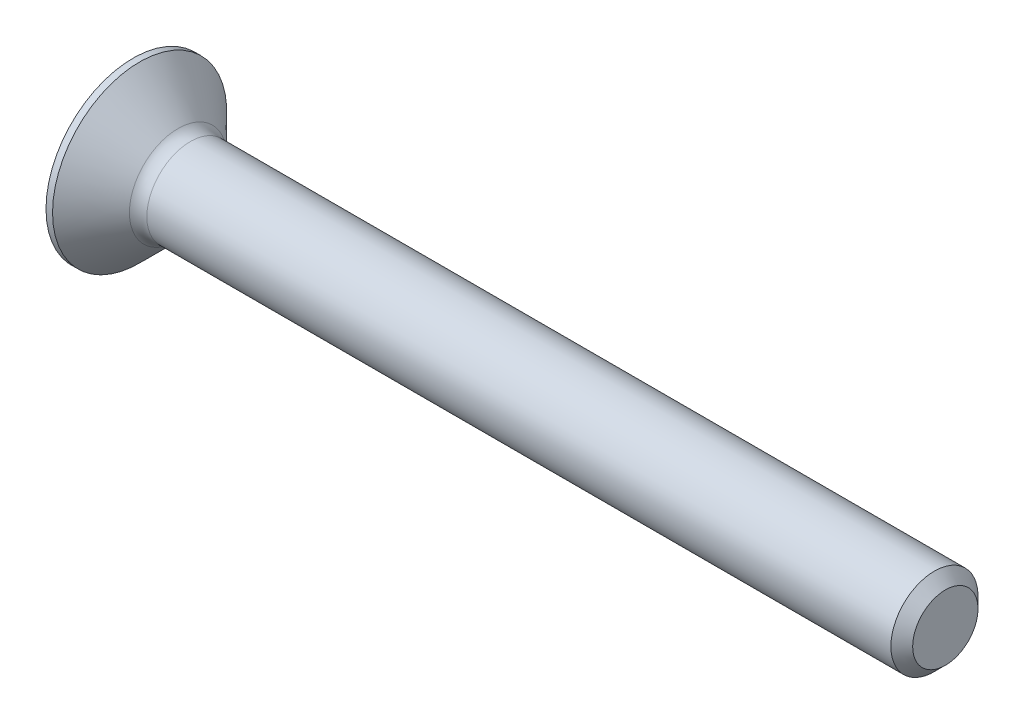
ISO-10303-21;
HEADER;
FILE_DESCRIPTION(('STEP AP214'),'2;1');
FILE_NAME('part.step','',(''),(''),'','','');
FILE_SCHEMA(('AUTOMOTIVE_DESIGN { 1 0 10303 214 1 1 1 1 }'));
ENDSEC;
DATA;
#1=APPLICATION_CONTEXT('core data for automotive mechanical design processes');
#2=APPLICATION_PROTOCOL_DEFINITION('international standard','automotive_design',2000,#1);
#3=PRODUCT_CONTEXT('',#1,'mechanical');
#4=PRODUCT('Part','Part','',(#3));
#5=PRODUCT_RELATED_PRODUCT_CATEGORY('part','',(#4));
#6=PRODUCT_DEFINITION_FORMATION('','',#4);
#7=PRODUCT_DEFINITION_CONTEXT('part definition',#1,'design');
#8=PRODUCT_DEFINITION('design','',#6,#7);
#9=PRODUCT_DEFINITION_SHAPE('','',#8);
#10=(LENGTH_UNIT() NAMED_UNIT(*) SI_UNIT(.MILLI.,.METRE.));
#11=(NAMED_UNIT(*) PLANE_ANGLE_UNIT() SI_UNIT($,.RADIAN.));
#12=(NAMED_UNIT(*) SI_UNIT($,.STERADIAN.) SOLID_ANGLE_UNIT());
#13=UNCERTAINTY_MEASURE_WITH_UNIT(LENGTH_MEASURE(1.E-05),#10,'distance_accuracy_value','');
#14=(GEOMETRIC_REPRESENTATION_CONTEXT(3) GLOBAL_UNCERTAINTY_ASSIGNED_CONTEXT((#13)) GLOBAL_UNIT_ASSIGNED_CONTEXT((#10,
#11,#12)) REPRESENTATION_CONTEXT('',''));
#15=CARTESIAN_POINT('',(0.,0.,0.));
#16=DIRECTION('',(0.,0.,1.));
#17=DIRECTION('',(1.,0.,0.));
#18=AXIS2_PLACEMENT_3D('',#15,#16,#17);
#19=CARTESIAN_POINT('',(0.,0.,0.));
#20=DIRECTION('',(-1.,0.,0.));
#21=DIRECTION('',(0.,0.,1.));
#22=AXIS2_PLACEMENT_3D('',#19,#20,#21);
#23=PLANE('',#22);
#24=CARTESIAN_POINT('',(0.,0.,0.));
#25=DIRECTION('',(-1.,0.,0.));
#26=DIRECTION('',(0.,0.,1.));
#27=AXIS2_PLACEMENT_3D('',#24,#25,#26);
#28=CIRCLE('',#27,4.);
#29=CARTESIAN_POINT('',(0.,0.,4.));
#30=VERTEX_POINT('',#29);
#31=EDGE_CURVE('E131',#30,#30,#28,.T.);
#32=ORIENTED_EDGE('',*,*,#31,.T.);
#33=EDGE_LOOP('',(#32));
#34=FACE_BOUND('',#33,.T.);
#35=DIRECTION('',(0.,-0.5,-0.866025403784439));
#36=VECTOR('',#35,1.);
#37=CARTESIAN_POINT('',(0.,-0.721687836487032,1.25));
#38=LINE('',#37,#36);
#39=CARTESIAN_POINT('',(0.,-0.721687836487032,1.25));
#40=VERTEX_POINT('',#39);
#41=CARTESIAN_POINT('',(0.,-1.44337567297406,0.));
#42=VERTEX_POINT('',#41);
#43=EDGE_CURVE('E32',#40,#42,#38,.T.);
#44=ORIENTED_EDGE('',*,*,#43,.T.);
#45=DIRECTION('',(0.,0.5,-0.866025403784439));
#46=VECTOR('',#45,1.);
#47=CARTESIAN_POINT('',(0.,-1.44337567297406,0.));
#48=LINE('',#47,#46);
#49=CARTESIAN_POINT('',(0.,-0.721687836487032,-1.25));
#50=VERTEX_POINT('',#49);
#51=EDGE_CURVE('E102',#42,#50,#48,.T.);
#52=ORIENTED_EDGE('',*,*,#51,.T.);
#53=DIRECTION('',(0.,1.,0.));
#54=VECTOR('',#53,1.);
#55=CARTESIAN_POINT('',(0.,-0.721687836487032,-1.25));
#56=LINE('',#55,#54);
#57=CARTESIAN_POINT('',(0.,0.721687836487033,-1.25));
#58=VERTEX_POINT('',#57);
#59=EDGE_CURVE('E104',#50,#58,#56,.T.);
#60=ORIENTED_EDGE('',*,*,#59,.T.);
#61=DIRECTION('',(0.,0.5,0.866025403784438));
#62=VECTOR('',#61,1.);
#63=CARTESIAN_POINT('',(0.,0.721687836487033,-1.25));
#64=LINE('',#63,#62);
#65=CARTESIAN_POINT('',(0.,1.44337567297407,0.));
#66=VERTEX_POINT('',#65);
#67=EDGE_CURVE('E106',#58,#66,#64,.T.);
#68=ORIENTED_EDGE('',*,*,#67,.T.);
#69=DIRECTION('',(0.,-0.5,0.866025403784439));
#70=VECTOR('',#69,1.);
#71=CARTESIAN_POINT('',(0.,1.44337567297407,0.));
#72=LINE('',#71,#70);
#73=CARTESIAN_POINT('',(0.,0.721687836487033,1.25));
#74=VERTEX_POINT('',#73);
#75=EDGE_CURVE('E108',#66,#74,#72,.T.);
#76=ORIENTED_EDGE('',*,*,#75,.T.);
#77=DIRECTION('',(0.,-1.,0.));
#78=VECTOR('',#77,1.);
#79=CARTESIAN_POINT('',(0.,0.721687836487033,1.25));
#80=LINE('',#79,#78);
#81=EDGE_CURVE('E61',#74,#40,#80,.T.);
#82=ORIENTED_EDGE('',*,*,#81,.T.);
#83=EDGE_LOOP('',(#44,#52,#60,#68,#76,#82));
#84=FACE_BOUND('',#83,.T.);
#85=ADVANCED_FACE('F17',(#34,#84),#23,.T.);
#86=CARTESIAN_POINT('',(0.,0.,0.));
#87=DIRECTION('',(-1.,0.,0.));
#88=DIRECTION('',(0.,0.,1.));
#89=AXIS2_PLACEMENT_3D('',#86,#87,#88);
#90=CYLINDRICAL_SURFACE('',#89,4.);
#91=CARTESIAN_POINT('',(0.30000000000001,0.,0.));
#92=DIRECTION('',(-1.,0.,0.));
#93=DIRECTION('',(0.,0.,1.));
#94=AXIS2_PLACEMENT_3D('',#91,#92,#93);
#95=CIRCLE('',#94,4.);
#96=CARTESIAN_POINT('',(0.30000000000001,0.,4.));
#97=VERTEX_POINT('',#96);
#98=EDGE_CURVE('E128',#97,#97,#95,.T.);
#99=ORIENTED_EDGE('',*,*,#98,.T.);
#100=EDGE_LOOP('',(#99));
#101=FACE_BOUND('',#100,.T.);
#102=ORIENTED_EDGE('',*,*,#31,.F.);
#103=EDGE_LOOP('',(#102));
#104=FACE_BOUND('',#103,.T.);
#105=ADVANCED_FACE('F156',(#101,#104),#90,.T.);
#106=CARTESIAN_POINT('',(0.30000000000001,0.,0.));
#107=DIRECTION('',(-1.,0.,0.));
#108=DIRECTION('',(0.,0.,1.));
#109=AXIS2_PLACEMENT_3D('',#106,#107,#108);
#110=CONICAL_SURFACE('',#109,4.,0.78539816339745);
#111=CARTESIAN_POINT('',(2.06568542494924,0.,0.));
#112=DIRECTION('',(-1.,0.,0.));
#113=DIRECTION('',(0.,0.,1.));
#114=AXIS2_PLACEMENT_3D('',#111,#112,#113);
#115=CIRCLE('',#114,2.23431457505077);
#116=CARTESIAN_POINT('',(2.06568542494924,0.,2.23431457505077));
#117=VERTEX_POINT('',#116);
#118=EDGE_CURVE('E25',#117,#117,#115,.T.);
#119=ORIENTED_EDGE('',*,*,#118,.T.);
#120=EDGE_LOOP('',(#119));
#121=FACE_BOUND('',#120,.T.);
#122=ORIENTED_EDGE('',*,*,#98,.F.);
#123=EDGE_LOOP('',(#122));
#124=FACE_BOUND('',#123,.T.);
#125=ADVANCED_FACE('F136',(#121,#124),#110,.T.);
#126=CARTESIAN_POINT('',(0.,0.,0.));
#127=DIRECTION('',(-1.,0.,0.));
#128=DIRECTION('',(0.,0.,1.));
#129=AXIS2_PLACEMENT_3D('',#126,#127,#128);
#130=CYLINDRICAL_SURFACE('',#129,2.);
#131=CARTESIAN_POINT('',(2.63137084989848,0.,0.));
#132=DIRECTION('',(-1.,0.,0.));
#133=DIRECTION('',(0.,0.,1.));
#134=AXIS2_PLACEMENT_3D('',#131,#132,#133);
#135=CIRCLE('',#134,2.);
#136=CARTESIAN_POINT('',(2.63137084989848,0.,2.));
#137=VERTEX_POINT('',#136);
#138=EDGE_CURVE('E11',#137,#137,#135,.F.);
#139=ORIENTED_EDGE('',*,*,#138,.T.);
#140=EDGE_LOOP('',(#139));
#141=FACE_BOUND('',#140,.T.);
#142=CARTESIAN_POINT('',(36.8,0.,0.));
#143=DIRECTION('',(-1.,0.,0.));
#144=DIRECTION('',(0.,0.,1.));
#145=AXIS2_PLACEMENT_3D('',#142,#143,#144);
#146=CIRCLE('',#145,2.);
#147=CARTESIAN_POINT('',(36.8,0.,2.));
#148=VERTEX_POINT('',#147);
#149=EDGE_CURVE('E125',#148,#148,#146,.T.);
#150=ORIENTED_EDGE('',*,*,#149,.T.);
#151=EDGE_LOOP('',(#150));
#152=FACE_BOUND('',#151,.T.);
#153=ADVANCED_FACE('F166',(#141,#152),#130,.T.);
#154=CARTESIAN_POINT('',(37.3,0.,0.));
#155=DIRECTION('',(-1.,0.,0.));
#156=DIRECTION('',(0.,0.,1.));
#157=AXIS2_PLACEMENT_3D('',#154,#155,#156);
#158=CONICAL_SURFACE('',#157,1.5,0.785398163397462);
#159=ORIENTED_EDGE('',*,*,#149,.F.);
#160=EDGE_LOOP('',(#159));
#161=FACE_BOUND('',#160,.T.);
#162=CARTESIAN_POINT('',(37.3,0.,0.));
#163=DIRECTION('',(-1.,0.,0.));
#164=DIRECTION('',(0.,0.,1.));
#165=AXIS2_PLACEMENT_3D('',#162,#163,#164);
#166=CIRCLE('',#165,1.5);
#167=CARTESIAN_POINT('',(37.3,0.,1.5));
#168=VERTEX_POINT('',#167);
#169=EDGE_CURVE('E122',#168,#168,#166,.T.);
#170=ORIENTED_EDGE('',*,*,#169,.T.);
#171=EDGE_LOOP('',(#170));
#172=FACE_BOUND('',#171,.T.);
#173=ADVANCED_FACE('F151',(#161,#172),#158,.T.);
#174=CARTESIAN_POINT('',(37.3,1.5,0.));
#175=DIRECTION('',(1.,0.,0.));
#176=DIRECTION('',(0.,0.,-1.));
#177=AXIS2_PLACEMENT_3D('',#174,#175,#176);
#178=PLANE('',#177);
#179=ORIENTED_EDGE('',*,*,#169,.F.);
#180=EDGE_LOOP('',(#179));
#181=FACE_BOUND('',#180,.T.);
#182=ADVANCED_FACE('F141',(#181),#178,.T.);
#183=CARTESIAN_POINT('',(2.63137084989848,0.,0.));
#184=DIRECTION('',(-1.,0.,0.));
#185=DIRECTION('',(0.,0.,1.));
#186=AXIS2_PLACEMENT_3D('',#183,#184,#185);
#187=TOROIDAL_SURFACE('',#186,2.8,0.8);
#188=ORIENTED_EDGE('',*,*,#138,.F.);
#189=EDGE_LOOP('',(#188));
#190=FACE_BOUND('',#189,.T.);
#191=ORIENTED_EDGE('',*,*,#118,.F.);
#192=EDGE_LOOP('',(#191));
#193=FACE_BOUND('',#192,.T.);
#194=ADVANCED_FACE('F19',(#190,#193),#187,.F.);
#195=CARTESIAN_POINT('',(5.6,-1.44337567297406,0.));
#196=DIRECTION('',(0.,0.866025403784439,0.5));
#197=DIRECTION('',(0.,-0.5,0.866025403784439));
#198=AXIS2_PLACEMENT_3D('',#195,#196,#197);
#199=PLANE('',#198);
#200=ORIENTED_EDGE('',*,*,#51,.F.);
#201=DIRECTION('',(-1.,0.,0.));
#202=VECTOR('',#201,1.);
#203=CARTESIAN_POINT('',(5.6,-1.44337567297406,0.));
#204=LINE('',#203,#202);
#205=CARTESIAN_POINT('',(5.6,-1.44337567297406,0.));
#206=VERTEX_POINT('',#205);
#207=EDGE_CURVE('E98',#206,#42,#204,.T.);
#208=ORIENTED_EDGE('',*,*,#207,.F.);
#209=DIRECTION('',(0.,0.5,-0.866025403784439));
#210=VECTOR('',#209,1.);
#211=CARTESIAN_POINT('',(5.6,-1.44337567297406,0.));
#212=LINE('',#211,#210);
#213=CARTESIAN_POINT('',(5.6,-0.721687836487032,-1.25));
#214=VERTEX_POINT('',#213);
#215=EDGE_CURVE('E112',#206,#214,#212,.T.);
#216=ORIENTED_EDGE('',*,*,#215,.T.);
#217=DIRECTION('',(-1.,0.,0.));
#218=VECTOR('',#217,1.);
#219=CARTESIAN_POINT('',(5.6,-0.721687836487032,-1.25));
#220=LINE('',#219,#218);
#221=EDGE_CURVE('E119',#214,#50,#220,.T.);
#222=ORIENTED_EDGE('',*,*,#221,.T.);
#223=EDGE_LOOP('',(#200,#208,#216,#222));
#224=FACE_BOUND('',#223,.T.);
#225=ADVANCED_FACE('F140',(#224),#199,.T.);
#226=CARTESIAN_POINT('',(5.6,-0.721687836487032,-1.25));
#227=DIRECTION('',(0.,0.,1.));
#228=DIRECTION('',(0.,-1.,0.));
#229=AXIS2_PLACEMENT_3D('',#226,#227,#228);
#230=PLANE('',#229);
#231=ORIENTED_EDGE('',*,*,#59,.F.);
#232=ORIENTED_EDGE('',*,*,#221,.F.);
#233=DIRECTION('',(0.,1.,0.));
#234=VECTOR('',#233,1.);
#235=CARTESIAN_POINT('',(5.6,-0.721687836487032,-1.25));
#236=LINE('',#235,#234);
#237=CARTESIAN_POINT('',(5.6,0.721687836487033,-1.25));
#238=VERTEX_POINT('',#237);
#239=EDGE_CURVE('E70',#214,#238,#236,.T.);
#240=ORIENTED_EDGE('',*,*,#239,.T.);
#241=DIRECTION('',(-1.,0.,0.));
#242=VECTOR('',#241,1.);
#243=CARTESIAN_POINT('',(5.6,0.721687836487033,-1.25));
#244=LINE('',#243,#242);
#245=EDGE_CURVE('E116',#238,#58,#244,.T.);
#246=ORIENTED_EDGE('',*,*,#245,.T.);
#247=EDGE_LOOP('',(#231,#232,#240,#246));
#248=FACE_BOUND('',#247,.T.);
#249=ADVANCED_FACE('F148',(#248),#230,.T.);
#250=CARTESIAN_POINT('',(5.6,0.721687836487033,-1.25));
#251=DIRECTION('',(0.,-0.866025403784438,0.5));
#252=DIRECTION('',(0.,-0.5,-0.866025403784438));
#253=AXIS2_PLACEMENT_3D('',#250,#251,#252);
#254=PLANE('',#253);
#255=ORIENTED_EDGE('',*,*,#67,.F.);
#256=ORIENTED_EDGE('',*,*,#245,.F.);
#257=DIRECTION('',(0.,0.5,0.866025403784438));
#258=VECTOR('',#257,1.);
#259=CARTESIAN_POINT('',(5.6,0.721687836487033,-1.25));
#260=LINE('',#259,#258);
#261=CARTESIAN_POINT('',(5.6,1.44337567297407,0.));
#262=VERTEX_POINT('',#261);
#263=EDGE_CURVE('E90',#238,#262,#260,.T.);
#264=ORIENTED_EDGE('',*,*,#263,.T.);
#265=DIRECTION('',(-1.,0.,0.));
#266=VECTOR('',#265,1.);
#267=CARTESIAN_POINT('',(5.6,1.44337567297407,0.));
#268=LINE('',#267,#266);
#269=EDGE_CURVE('E87',#262,#66,#268,.T.);
#270=ORIENTED_EDGE('',*,*,#269,.T.);
#271=EDGE_LOOP('',(#255,#256,#264,#270));
#272=FACE_BOUND('',#271,.T.);
#273=ADVANCED_FACE('F175',(#272),#254,.T.);
#274=CARTESIAN_POINT('',(5.6,1.44337567297407,0.));
#275=DIRECTION('',(0.,-0.866025403784438,-0.5));
#276=DIRECTION('',(0.,0.5,-0.866025403784438));
#277=AXIS2_PLACEMENT_3D('',#274,#275,#276);
#278=PLANE('',#277);
#279=ORIENTED_EDGE('',*,*,#75,.F.);
#280=ORIENTED_EDGE('',*,*,#269,.F.);
#281=DIRECTION('',(0.,-0.5,0.866025403784439));
#282=VECTOR('',#281,1.);
#283=CARTESIAN_POINT('',(5.6,1.44337567297407,0.));
#284=LINE('',#283,#282);
#285=CARTESIAN_POINT('',(5.6,0.721687836487033,1.25));
#286=VERTEX_POINT('',#285);
#287=EDGE_CURVE('E81',#262,#286,#284,.T.);
#288=ORIENTED_EDGE('',*,*,#287,.T.);
#289=DIRECTION('',(-1.,0.,0.));
#290=VECTOR('',#289,1.);
#291=CARTESIAN_POINT('',(5.6,0.721687836487033,1.25));
#292=LINE('',#291,#290);
#293=EDGE_CURVE('E85',#286,#74,#292,.T.);
#294=ORIENTED_EDGE('',*,*,#293,.T.);
#295=EDGE_LOOP('',(#279,#280,#288,#294));
#296=FACE_BOUND('',#295,.T.);
#297=ADVANCED_FACE('F84',(#296),#278,.T.);
#298=CARTESIAN_POINT('',(5.6,0.721687836487033,1.25));
#299=DIRECTION('',(0.,0.,-1.));
#300=DIRECTION('',(-1.,0.,0.));
#301=AXIS2_PLACEMENT_3D('',#298,#299,#300);
#302=PLANE('',#301);
#303=ORIENTED_EDGE('',*,*,#81,.F.);
#304=ORIENTED_EDGE('',*,*,#293,.F.);
#305=DIRECTION('',(0.,-1.,0.));
#306=VECTOR('',#305,1.);
#307=CARTESIAN_POINT('',(5.6,0.721687836487033,1.25));
#308=LINE('',#307,#306);
#309=CARTESIAN_POINT('',(5.6,-0.721687836487032,1.25));
#310=VERTEX_POINT('',#309);
#311=EDGE_CURVE('E89',#286,#310,#308,.T.);
#312=ORIENTED_EDGE('',*,*,#311,.T.);
#313=DIRECTION('',(-1.,0.,0.));
#314=VECTOR('',#313,1.);
#315=CARTESIAN_POINT('',(5.6,-0.721687836487032,1.25));
#316=LINE('',#315,#314);
#317=EDGE_CURVE('E94',#310,#40,#316,.T.);
#318=ORIENTED_EDGE('',*,*,#317,.T.);
#319=EDGE_LOOP('',(#303,#304,#312,#318));
#320=FACE_BOUND('',#319,.T.);
#321=ADVANCED_FACE('F93',(#320),#302,.T.);
#322=CARTESIAN_POINT('',(5.6,-0.721687836487032,1.25));
#323=DIRECTION('',(0.,0.866025403784439,-0.5));
#324=DIRECTION('',(0.,0.5,0.866025403784439));
#325=AXIS2_PLACEMENT_3D('',#322,#323,#324);
#326=PLANE('',#325);
#327=ORIENTED_EDGE('',*,*,#43,.F.);
#328=ORIENTED_EDGE('',*,*,#317,.F.);
#329=DIRECTION('',(0.,-0.5,-0.866025403784439));
#330=VECTOR('',#329,1.);
#331=CARTESIAN_POINT('',(5.6,-0.721687836487032,1.25));
#332=LINE('',#331,#330);
#333=EDGE_CURVE('E41',#310,#206,#332,.T.);
#334=ORIENTED_EDGE('',*,*,#333,.T.);
#335=ORIENTED_EDGE('',*,*,#207,.T.);
#336=EDGE_LOOP('',(#327,#328,#334,#335));
#337=FACE_BOUND('',#336,.T.);
#338=ADVANCED_FACE('F184',(#337),#326,.T.);
#339=CARTESIAN_POINT('',(5.6,0.,-2.5));
#340=DIRECTION('',(1.,0.,0.));
#341=DIRECTION('',(0.,0.,-1.));
#342=AXIS2_PLACEMENT_3D('',#339,#340,#341);
#343=PLANE('',#342);
#344=ORIENTED_EDGE('',*,*,#215,.F.);
#345=ORIENTED_EDGE('',*,*,#333,.F.);
#346=ORIENTED_EDGE('',*,*,#311,.F.);
#347=ORIENTED_EDGE('',*,*,#287,.F.);
#348=ORIENTED_EDGE('',*,*,#263,.F.);
#349=ORIENTED_EDGE('',*,*,#239,.F.);
#350=EDGE_LOOP('',(#344,#345,#346,#347,#348,#349));
#351=FACE_BOUND('',#350,.T.);
#352=ADVANCED_FACE('F96',(#351),#343,.F.);
#353=CLOSED_SHELL('',(#85,#105,#125,#153,#173,#182,#194,#225,#249,#273,#297,#321,#338,#352));
#354=MANIFOLD_SOLID_BREP('B1',#353);
#355=ADVANCED_BREP_SHAPE_REPRESENTATION('',(#18,#354),#14);
#356=SHAPE_DEFINITION_REPRESENTATION(#9,#355);
ENDSEC;
END-ISO-10303-21;
